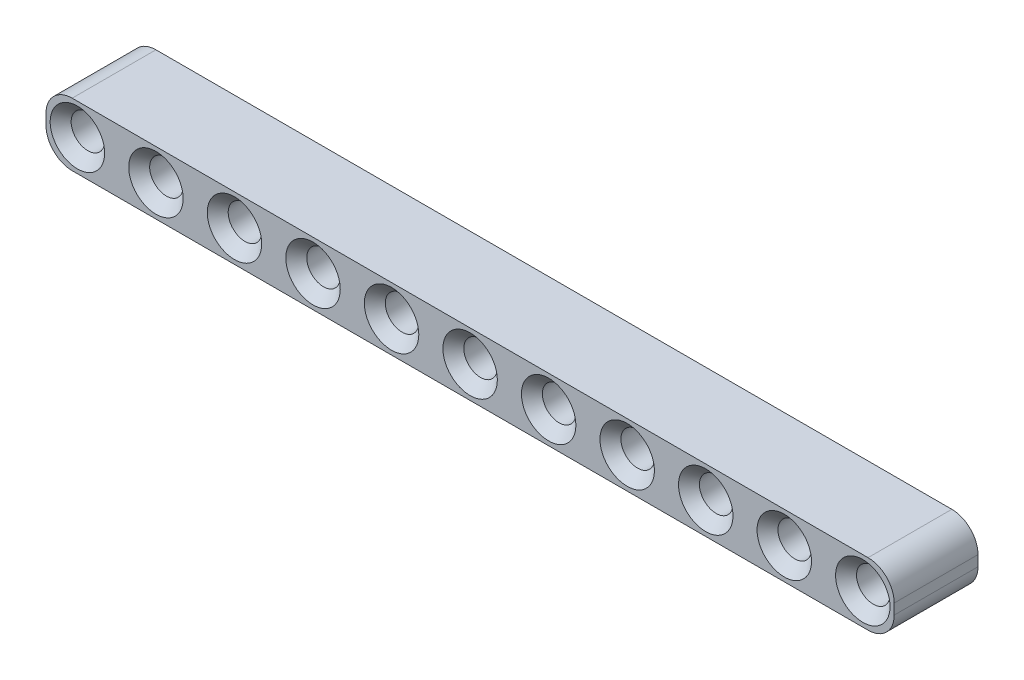
ISO-10303-21;
HEADER;
FILE_DESCRIPTION(('STEP AP214'),'2;1');
FILE_NAME('part.step','',(''),(''),'','','');
FILE_SCHEMA(('AUTOMOTIVE_DESIGN { 1 0 10303 214 1 1 1 1 }'));
ENDSEC;
DATA;
#1=APPLICATION_CONTEXT('core data for automotive mechanical design processes');
#2=APPLICATION_PROTOCOL_DEFINITION('international standard','automotive_design',2000,#1);
#3=PRODUCT_CONTEXT('',#1,'mechanical');
#4=PRODUCT('Part','Part','',(#3));
#5=PRODUCT_RELATED_PRODUCT_CATEGORY('part','',(#4));
#6=PRODUCT_DEFINITION_FORMATION('','',#4);
#7=PRODUCT_DEFINITION_CONTEXT('part definition',#1,'design');
#8=PRODUCT_DEFINITION('design','',#6,#7);
#9=PRODUCT_DEFINITION_SHAPE('','',#8);
#10=(LENGTH_UNIT() NAMED_UNIT(*) SI_UNIT(.MILLI.,.METRE.));
#11=(NAMED_UNIT(*) PLANE_ANGLE_UNIT() SI_UNIT($,.RADIAN.));
#12=(NAMED_UNIT(*) SI_UNIT($,.STERADIAN.) SOLID_ANGLE_UNIT());
#13=UNCERTAINTY_MEASURE_WITH_UNIT(LENGTH_MEASURE(1.E-05),#10,'distance_accuracy_value','');
#14=(GEOMETRIC_REPRESENTATION_CONTEXT(3) GLOBAL_UNCERTAINTY_ASSIGNED_CONTEXT((#13)) GLOBAL_UNIT_ASSIGNED_CONTEXT((#10,
#11,#12)) REPRESENTATION_CONTEXT('',''));
#15=CARTESIAN_POINT('',(0.,0.,0.));
#16=DIRECTION('',(0.,0.,1.));
#17=DIRECTION('',(1.,0.,0.));
#18=AXIS2_PLACEMENT_3D('',#15,#16,#17);
#19=CARTESIAN_POINT('',(75.5,-0.5,8.));
#20=DIRECTION('',(0.,0.,1.));
#21=DIRECTION('',(1.,0.,0.));
#22=AXIS2_PLACEMENT_3D('',#19,#20,#21);
#23=PLANE('',#22);
#24=CARTESIAN_POINT('',(75.,0.,8.));
#25=DIRECTION('',(0.,0.,1.));
#26=DIRECTION('',(1.,0.,0.));
#27=AXIS2_PLACEMENT_3D('',#24,#25,#26);
#28=CIRCLE('',#27,2.60000000000002);
#29=CARTESIAN_POINT('',(77.6,0.,8.));
#30=VERTEX_POINT('',#29);
#31=EDGE_CURVE('E228',#30,#30,#28,.F.);
#32=ORIENTED_EDGE('',*,*,#31,.T.);
#33=EDGE_LOOP('',(#32));
#34=FACE_BOUND('',#33,.T.);
#35=CARTESIAN_POINT('',(67.5,0.,8.));
#36=DIRECTION('',(0.,0.,1.));
#37=DIRECTION('',(1.,0.,0.));
#38=AXIS2_PLACEMENT_3D('',#35,#36,#37);
#39=CIRCLE('',#38,2.6);
#40=CARTESIAN_POINT('',(70.1,0.,8.));
#41=VERTEX_POINT('',#40);
#42=EDGE_CURVE('E225',#41,#41,#39,.F.);
#43=ORIENTED_EDGE('',*,*,#42,.T.);
#44=EDGE_LOOP('',(#43));
#45=FACE_BOUND('',#44,.T.);
#46=CARTESIAN_POINT('',(60.,0.,8.));
#47=DIRECTION('',(0.,0.,1.));
#48=DIRECTION('',(1.,0.,0.));
#49=AXIS2_PLACEMENT_3D('',#46,#47,#48);
#50=CIRCLE('',#49,2.6);
#51=CARTESIAN_POINT('',(62.6,0.,8.));
#52=VERTEX_POINT('',#51);
#53=EDGE_CURVE('E222',#52,#52,#50,.F.);
#54=ORIENTED_EDGE('',*,*,#53,.T.);
#55=EDGE_LOOP('',(#54));
#56=FACE_BOUND('',#55,.T.);
#57=CARTESIAN_POINT('',(52.5,0.,8.));
#58=DIRECTION('',(0.,0.,1.));
#59=DIRECTION('',(1.,0.,0.));
#60=AXIS2_PLACEMENT_3D('',#57,#58,#59);
#61=CIRCLE('',#60,2.6);
#62=CARTESIAN_POINT('',(55.1,0.,8.));
#63=VERTEX_POINT('',#62);
#64=EDGE_CURVE('E219',#63,#63,#61,.F.);
#65=ORIENTED_EDGE('',*,*,#64,.T.);
#66=EDGE_LOOP('',(#65));
#67=FACE_BOUND('',#66,.T.);
#68=CARTESIAN_POINT('',(45.,0.,8.));
#69=DIRECTION('',(0.,0.,1.));
#70=DIRECTION('',(1.,0.,0.));
#71=AXIS2_PLACEMENT_3D('',#68,#69,#70);
#72=CIRCLE('',#71,2.6);
#73=CARTESIAN_POINT('',(47.6,0.,8.));
#74=VERTEX_POINT('',#73);
#75=EDGE_CURVE('E216',#74,#74,#72,.F.);
#76=ORIENTED_EDGE('',*,*,#75,.T.);
#77=EDGE_LOOP('',(#76));
#78=FACE_BOUND('',#77,.T.);
#79=CARTESIAN_POINT('',(37.5,0.,8.));
#80=DIRECTION('',(0.,0.,1.));
#81=DIRECTION('',(1.,0.,0.));
#82=AXIS2_PLACEMENT_3D('',#79,#80,#81);
#83=CIRCLE('',#82,2.6);
#84=CARTESIAN_POINT('',(40.1,0.,8.));
#85=VERTEX_POINT('',#84);
#86=EDGE_CURVE('E213',#85,#85,#83,.F.);
#87=ORIENTED_EDGE('',*,*,#86,.T.);
#88=EDGE_LOOP('',(#87));
#89=FACE_BOUND('',#88,.T.);
#90=CARTESIAN_POINT('',(30.,0.,8.));
#91=DIRECTION('',(0.,0.,1.));
#92=DIRECTION('',(1.,0.,0.));
#93=AXIS2_PLACEMENT_3D('',#90,#91,#92);
#94=CIRCLE('',#93,2.6);
#95=CARTESIAN_POINT('',(32.6,0.,8.));
#96=VERTEX_POINT('',#95);
#97=EDGE_CURVE('E210',#96,#96,#94,.F.);
#98=ORIENTED_EDGE('',*,*,#97,.T.);
#99=EDGE_LOOP('',(#98));
#100=FACE_BOUND('',#99,.T.);
#101=CARTESIAN_POINT('',(22.5,0.,8.));
#102=DIRECTION('',(0.,0.,1.));
#103=DIRECTION('',(1.,0.,0.));
#104=AXIS2_PLACEMENT_3D('',#101,#102,#103);
#105=CIRCLE('',#104,2.6);
#106=CARTESIAN_POINT('',(25.1,0.,8.));
#107=VERTEX_POINT('',#106);
#108=EDGE_CURVE('E207',#107,#107,#105,.F.);
#109=ORIENTED_EDGE('',*,*,#108,.T.);
#110=EDGE_LOOP('',(#109));
#111=FACE_BOUND('',#110,.T.);
#112=CARTESIAN_POINT('',(15.,0.,8.));
#113=DIRECTION('',(0.,0.,1.));
#114=DIRECTION('',(1.,0.,0.));
#115=AXIS2_PLACEMENT_3D('',#112,#113,#114);
#116=CIRCLE('',#115,2.6);
#117=CARTESIAN_POINT('',(17.6,0.,8.));
#118=VERTEX_POINT('',#117);
#119=EDGE_CURVE('E204',#118,#118,#116,.F.);
#120=ORIENTED_EDGE('',*,*,#119,.T.);
#121=EDGE_LOOP('',(#120));
#122=FACE_BOUND('',#121,.T.);
#123=CARTESIAN_POINT('',(7.5,0.,8.));
#124=DIRECTION('',(0.,0.,1.));
#125=DIRECTION('',(1.,0.,0.));
#126=AXIS2_PLACEMENT_3D('',#123,#124,#125);
#127=CIRCLE('',#126,2.60000000000001);
#128=CARTESIAN_POINT('',(10.1,0.,8.));
#129=VERTEX_POINT('',#128);
#130=EDGE_CURVE('E201',#129,#129,#127,.F.);
#131=ORIENTED_EDGE('',*,*,#130,.T.);
#132=EDGE_LOOP('',(#131));
#133=FACE_BOUND('',#132,.T.);
#134=CARTESIAN_POINT('',(0.,0.,8.));
#135=DIRECTION('',(0.,0.,1.));
#136=DIRECTION('',(1.,0.,0.));
#137=AXIS2_PLACEMENT_3D('',#134,#135,#136);
#138=CIRCLE('',#137,2.6);
#139=CARTESIAN_POINT('',(2.6,0.,8.));
#140=VERTEX_POINT('',#139);
#141=EDGE_CURVE('E198',#140,#140,#138,.F.);
#142=ORIENTED_EDGE('',*,*,#141,.T.);
#143=EDGE_LOOP('',(#142));
#144=FACE_BOUND('',#143,.T.);
#145=CARTESIAN_POINT('',(75.5,-0.5,8.));
#146=DIRECTION('',(0.,0.,1.));
#147=DIRECTION('',(1.,0.,0.));
#148=AXIS2_PLACEMENT_3D('',#145,#146,#147);
#149=CIRCLE('',#148,2.49999999999999);
#150=CARTESIAN_POINT('',(75.5,-3.,8.));
#151=VERTEX_POINT('',#150);
#152=CARTESIAN_POINT('',(78.,-0.5,8.));
#153=VERTEX_POINT('',#152);
#154=EDGE_CURVE('E144',#151,#153,#149,.T.);
#155=ORIENTED_EDGE('',*,*,#154,.T.);
#156=DIRECTION('',(0.,1.,0.));
#157=VECTOR('',#156,1.);
#158=CARTESIAN_POINT('',(78.,0.5,8.));
#159=LINE('',#158,#157);
#160=CARTESIAN_POINT('',(78.,0.5,8.));
#161=VERTEX_POINT('',#160);
#162=EDGE_CURVE('E94',#153,#161,#159,.T.);
#163=ORIENTED_EDGE('',*,*,#162,.T.);
#164=CARTESIAN_POINT('',(75.5,0.5,8.));
#165=DIRECTION('',(0.,0.,1.));
#166=DIRECTION('',(-1.,0.,0.));
#167=AXIS2_PLACEMENT_3D('',#164,#165,#166);
#168=CIRCLE('',#167,2.49999999999999);
#169=CARTESIAN_POINT('',(75.5,3.,8.));
#170=VERTEX_POINT('',#169);
#171=EDGE_CURVE('E498',#161,#170,#168,.T.);
#172=ORIENTED_EDGE('',*,*,#171,.T.);
#173=DIRECTION('',(-1.,0.,0.));
#174=VECTOR('',#173,1.);
#175=CARTESIAN_POINT('',(-0.5,3.,8.));
#176=LINE('',#175,#174);
#177=CARTESIAN_POINT('',(-0.5,3.,8.));
#178=VERTEX_POINT('',#177);
#179=EDGE_CURVE('E502',#170,#178,#176,.T.);
#180=ORIENTED_EDGE('',*,*,#179,.T.);
#181=CARTESIAN_POINT('',(-0.5,0.5,8.));
#182=DIRECTION('',(0.,0.,1.));
#183=DIRECTION('',(1.,0.,0.));
#184=AXIS2_PLACEMENT_3D('',#181,#182,#183);
#185=CIRCLE('',#184,2.5);
#186=CARTESIAN_POINT('',(-3.,0.5,8.));
#187=VERTEX_POINT('',#186);
#188=EDGE_CURVE('E112',#178,#187,#185,.T.);
#189=ORIENTED_EDGE('',*,*,#188,.T.);
#190=DIRECTION('',(0.,-1.,0.));
#191=VECTOR('',#190,1.);
#192=CARTESIAN_POINT('',(-3.,0.5,8.));
#193=LINE('',#192,#191);
#194=CARTESIAN_POINT('',(-3.,-0.5,8.));
#195=VERTEX_POINT('',#194);
#196=EDGE_CURVE('E107',#187,#195,#193,.T.);
#197=ORIENTED_EDGE('',*,*,#196,.T.);
#198=CARTESIAN_POINT('',(-0.5,-0.5,8.));
#199=DIRECTION('',(0.,0.,1.));
#200=DIRECTION('',(1.,0.,0.));
#201=AXIS2_PLACEMENT_3D('',#198,#199,#200);
#202=CIRCLE('',#201,2.5);
#203=CARTESIAN_POINT('',(-0.5,-3.,8.));
#204=VERTEX_POINT('',#203);
#205=EDGE_CURVE('E110',#195,#204,#202,.T.);
#206=ORIENTED_EDGE('',*,*,#205,.T.);
#207=DIRECTION('',(1.,0.,0.));
#208=VECTOR('',#207,1.);
#209=CARTESIAN_POINT('',(-0.5,-3.,8.));
#210=LINE('',#209,#208);
#211=EDGE_CURVE('E50',#204,#151,#210,.T.);
#212=ORIENTED_EDGE('',*,*,#211,.T.);
#213=EDGE_LOOP('',(#155,#163,#172,#180,#189,#197,#206,#212));
#214=FACE_BOUND('',#213,.T.);
#215=ADVANCED_FACE('F33',(#34,#45,#56,#67,#78,#89,#100,#111,#122,#133,#144,#214),#23,.T.);
#216=CARTESIAN_POINT('',(75.5,-0.5,0.));
#217=DIRECTION('',(0.,0.,1.));
#218=DIRECTION('',(1.,0.,0.));
#219=AXIS2_PLACEMENT_3D('',#216,#217,#218);
#220=PLANE('',#219);
#221=CARTESIAN_POINT('',(75.,0.,0.));
#222=DIRECTION('',(0.,0.,1.));
#223=DIRECTION('',(1.,0.,0.));
#224=AXIS2_PLACEMENT_3D('',#221,#222,#223);
#225=CIRCLE('',#224,2.60000000000002);
#226=CARTESIAN_POINT('',(77.6,0.,0.));
#227=VERTEX_POINT('',#226);
#228=EDGE_CURVE('E189',#227,#227,#225,.T.);
#229=ORIENTED_EDGE('',*,*,#228,.T.);
#230=EDGE_LOOP('',(#229));
#231=FACE_BOUND('',#230,.T.);
#232=CARTESIAN_POINT('',(67.5,0.,0.));
#233=DIRECTION('',(0.,0.,1.));
#234=DIRECTION('',(1.,0.,0.));
#235=AXIS2_PLACEMENT_3D('',#232,#233,#234);
#236=CIRCLE('',#235,2.60000000000002);
#237=CARTESIAN_POINT('',(70.1,0.,0.));
#238=VERTEX_POINT('',#237);
#239=EDGE_CURVE('E186',#238,#238,#236,.T.);
#240=ORIENTED_EDGE('',*,*,#239,.T.);
#241=EDGE_LOOP('',(#240));
#242=FACE_BOUND('',#241,.T.);
#243=CARTESIAN_POINT('',(60.,0.,0.));
#244=DIRECTION('',(0.,0.,1.));
#245=DIRECTION('',(1.,0.,0.));
#246=AXIS2_PLACEMENT_3D('',#243,#244,#245);
#247=CIRCLE('',#246,2.6);
#248=CARTESIAN_POINT('',(62.6,0.,0.));
#249=VERTEX_POINT('',#248);
#250=EDGE_CURVE('E183',#249,#249,#247,.T.);
#251=ORIENTED_EDGE('',*,*,#250,.T.);
#252=EDGE_LOOP('',(#251));
#253=FACE_BOUND('',#252,.T.);
#254=CARTESIAN_POINT('',(52.5,0.,0.));
#255=DIRECTION('',(0.,0.,1.));
#256=DIRECTION('',(1.,0.,0.));
#257=AXIS2_PLACEMENT_3D('',#254,#255,#256);
#258=CIRCLE('',#257,2.59999999999998);
#259=CARTESIAN_POINT('',(55.1,0.,0.));
#260=VERTEX_POINT('',#259);
#261=EDGE_CURVE('E180',#260,#260,#258,.T.);
#262=ORIENTED_EDGE('',*,*,#261,.T.);
#263=EDGE_LOOP('',(#262));
#264=FACE_BOUND('',#263,.T.);
#265=CARTESIAN_POINT('',(45.,0.,0.));
#266=DIRECTION('',(0.,0.,1.));
#267=DIRECTION('',(1.,0.,0.));
#268=AXIS2_PLACEMENT_3D('',#265,#266,#267);
#269=CIRCLE('',#268,2.6);
#270=CARTESIAN_POINT('',(47.6,0.,0.));
#271=VERTEX_POINT('',#270);
#272=EDGE_CURVE('E177',#271,#271,#269,.T.);
#273=ORIENTED_EDGE('',*,*,#272,.T.);
#274=EDGE_LOOP('',(#273));
#275=FACE_BOUND('',#274,.T.);
#276=CARTESIAN_POINT('',(37.5,0.,0.));
#277=DIRECTION('',(0.,0.,1.));
#278=DIRECTION('',(1.,0.,0.));
#279=AXIS2_PLACEMENT_3D('',#276,#277,#278);
#280=CIRCLE('',#279,2.59999999999998);
#281=CARTESIAN_POINT('',(40.1,0.,0.));
#282=VERTEX_POINT('',#281);
#283=EDGE_CURVE('E174',#282,#282,#280,.T.);
#284=ORIENTED_EDGE('',*,*,#283,.T.);
#285=EDGE_LOOP('',(#284));
#286=FACE_BOUND('',#285,.T.);
#287=CARTESIAN_POINT('',(30.,0.,0.));
#288=DIRECTION('',(0.,0.,1.));
#289=DIRECTION('',(1.,0.,0.));
#290=AXIS2_PLACEMENT_3D('',#287,#288,#289);
#291=CIRCLE('',#290,2.59999999999999);
#292=CARTESIAN_POINT('',(32.6,0.,0.));
#293=VERTEX_POINT('',#292);
#294=EDGE_CURVE('E171',#293,#293,#291,.T.);
#295=ORIENTED_EDGE('',*,*,#294,.T.);
#296=EDGE_LOOP('',(#295));
#297=FACE_BOUND('',#296,.T.);
#298=CARTESIAN_POINT('',(22.5,0.,0.));
#299=DIRECTION('',(0.,0.,1.));
#300=DIRECTION('',(1.,0.,0.));
#301=AXIS2_PLACEMENT_3D('',#298,#299,#300);
#302=CIRCLE('',#301,2.59999999999999);
#303=CARTESIAN_POINT('',(25.1,0.,0.));
#304=VERTEX_POINT('',#303);
#305=EDGE_CURVE('E168',#304,#304,#302,.T.);
#306=ORIENTED_EDGE('',*,*,#305,.T.);
#307=EDGE_LOOP('',(#306));
#308=FACE_BOUND('',#307,.T.);
#309=CARTESIAN_POINT('',(15.,0.,0.));
#310=DIRECTION('',(0.,0.,1.));
#311=DIRECTION('',(1.,0.,0.));
#312=AXIS2_PLACEMENT_3D('',#309,#310,#311);
#313=CIRCLE('',#312,2.59999999999999);
#314=CARTESIAN_POINT('',(17.6,0.,0.));
#315=VERTEX_POINT('',#314);
#316=EDGE_CURVE('E165',#315,#315,#313,.T.);
#317=ORIENTED_EDGE('',*,*,#316,.T.);
#318=EDGE_LOOP('',(#317));
#319=FACE_BOUND('',#318,.T.);
#320=CARTESIAN_POINT('',(7.5,0.,0.));
#321=DIRECTION('',(0.,0.,1.));
#322=DIRECTION('',(1.,0.,0.));
#323=AXIS2_PLACEMENT_3D('',#320,#321,#322);
#324=CIRCLE('',#323,2.6);
#325=CARTESIAN_POINT('',(10.1,0.,0.));
#326=VERTEX_POINT('',#325);
#327=EDGE_CURVE('E162',#326,#326,#324,.T.);
#328=ORIENTED_EDGE('',*,*,#327,.T.);
#329=EDGE_LOOP('',(#328));
#330=FACE_BOUND('',#329,.T.);
#331=CARTESIAN_POINT('',(0.,0.,0.));
#332=DIRECTION('',(0.,0.,1.));
#333=DIRECTION('',(1.,0.,0.));
#334=AXIS2_PLACEMENT_3D('',#331,#332,#333);
#335=CIRCLE('',#334,2.6);
#336=CARTESIAN_POINT('',(2.6,0.,0.));
#337=VERTEX_POINT('',#336);
#338=EDGE_CURVE('E159',#337,#337,#335,.T.);
#339=ORIENTED_EDGE('',*,*,#338,.T.);
#340=EDGE_LOOP('',(#339));
#341=FACE_BOUND('',#340,.T.);
#342=CARTESIAN_POINT('',(75.5,-0.5,0.));
#343=DIRECTION('',(0.,0.,1.));
#344=DIRECTION('',(1.,0.,0.));
#345=AXIS2_PLACEMENT_3D('',#342,#343,#344);
#346=CIRCLE('',#345,2.49999999999999);
#347=CARTESIAN_POINT('',(75.5,-3.,0.));
#348=VERTEX_POINT('',#347);
#349=CARTESIAN_POINT('',(78.,-0.5,0.));
#350=VERTEX_POINT('',#349);
#351=EDGE_CURVE('E130',#348,#350,#346,.T.);
#352=ORIENTED_EDGE('',*,*,#351,.F.);
#353=DIRECTION('',(1.,0.,0.));
#354=VECTOR('',#353,1.);
#355=CARTESIAN_POINT('',(-0.5,-3.,0.));
#356=LINE('',#355,#354);
#357=CARTESIAN_POINT('',(-0.5,-3.,0.));
#358=VERTEX_POINT('',#357);
#359=EDGE_CURVE('E85',#358,#348,#356,.T.);
#360=ORIENTED_EDGE('',*,*,#359,.F.);
#361=CARTESIAN_POINT('',(-0.5,-0.5,0.));
#362=DIRECTION('',(0.,0.,1.));
#363=DIRECTION('',(1.,0.,0.));
#364=AXIS2_PLACEMENT_3D('',#361,#362,#363);
#365=CIRCLE('',#364,2.5);
#366=CARTESIAN_POINT('',(-3.,-0.5,0.));
#367=VERTEX_POINT('',#366);
#368=EDGE_CURVE('E79',#367,#358,#365,.T.);
#369=ORIENTED_EDGE('',*,*,#368,.F.);
#370=DIRECTION('',(0.,-1.,0.));
#371=VECTOR('',#370,1.);
#372=CARTESIAN_POINT('',(-3.,0.5,0.));
#373=LINE('',#372,#371);
#374=CARTESIAN_POINT('',(-3.,0.5,0.));
#375=VERTEX_POINT('',#374);
#376=EDGE_CURVE('E120',#375,#367,#373,.T.);
#377=ORIENTED_EDGE('',*,*,#376,.F.);
#378=CARTESIAN_POINT('',(-0.5,0.5,0.));
#379=DIRECTION('',(0.,0.,1.));
#380=DIRECTION('',(1.,0.,0.));
#381=AXIS2_PLACEMENT_3D('',#378,#379,#380);
#382=CIRCLE('',#381,2.5);
#383=CARTESIAN_POINT('',(-0.5,3.,0.));
#384=VERTEX_POINT('',#383);
#385=EDGE_CURVE('E139',#384,#375,#382,.T.);
#386=ORIENTED_EDGE('',*,*,#385,.F.);
#387=DIRECTION('',(-1.,0.,0.));
#388=VECTOR('',#387,1.);
#389=CARTESIAN_POINT('',(-0.5,3.,0.));
#390=LINE('',#389,#388);
#391=CARTESIAN_POINT('',(75.5,3.,0.));
#392=VERTEX_POINT('',#391);
#393=EDGE_CURVE('E137',#392,#384,#390,.T.);
#394=ORIENTED_EDGE('',*,*,#393,.F.);
#395=CARTESIAN_POINT('',(75.5,0.5,0.));
#396=DIRECTION('',(0.,0.,1.));
#397=DIRECTION('',(-1.,0.,0.));
#398=AXIS2_PLACEMENT_3D('',#395,#396,#397);
#399=CIRCLE('',#398,2.49999999999999);
#400=CARTESIAN_POINT('',(78.,0.5,0.));
#401=VERTEX_POINT('',#400);
#402=EDGE_CURVE('E135',#401,#392,#399,.T.);
#403=ORIENTED_EDGE('',*,*,#402,.F.);
#404=DIRECTION('',(0.,1.,0.));
#405=VECTOR('',#404,1.);
#406=CARTESIAN_POINT('',(78.,0.5,0.));
#407=LINE('',#406,#405);
#408=EDGE_CURVE('E133',#350,#401,#407,.T.);
#409=ORIENTED_EDGE('',*,*,#408,.F.);
#410=EDGE_LOOP('',(#352,#360,#369,#377,#386,#394,#403,#409));
#411=FACE_BOUND('',#410,.T.);
#412=ADVANCED_FACE('F299',(#231,#242,#253,#264,#275,#286,#297,#308,#319,#330,#341,#411),#220,.F.);
#413=CARTESIAN_POINT('',(75.5,-0.5,8.));
#414=DIRECTION('',(0.,0.,-1.));
#415=DIRECTION('',(-1.,0.,0.));
#416=AXIS2_PLACEMENT_3D('',#413,#414,#415);
#417=CYLINDRICAL_SURFACE('',#416,2.49999999999999);
#418=ORIENTED_EDGE('',*,*,#351,.T.);
#419=DIRECTION('',(0.,0.,-1.));
#420=VECTOR('',#419,1.);
#421=CARTESIAN_POINT('',(78.,-0.5,8.));
#422=LINE('',#421,#420);
#423=EDGE_CURVE('E157',#153,#350,#422,.T.);
#424=ORIENTED_EDGE('',*,*,#423,.F.);
#425=ORIENTED_EDGE('',*,*,#154,.F.);
#426=DIRECTION('',(0.,0.,-1.));
#427=VECTOR('',#426,1.);
#428=CARTESIAN_POINT('',(75.5,-3.,8.));
#429=LINE('',#428,#427);
#430=EDGE_CURVE('E126',#151,#348,#429,.T.);
#431=ORIENTED_EDGE('',*,*,#430,.T.);
#432=EDGE_LOOP('',(#418,#424,#425,#431));
#433=FACE_BOUND('',#432,.T.);
#434=ADVANCED_FACE('F305',(#433),#417,.T.);
#435=CARTESIAN_POINT('',(78.,0.5,8.));
#436=DIRECTION('',(-1.,0.,0.));
#437=DIRECTION('',(0.,0.,1.));
#438=AXIS2_PLACEMENT_3D('',#435,#436,#437);
#439=PLANE('',#438);
#440=ORIENTED_EDGE('',*,*,#408,.T.);
#441=DIRECTION('',(0.,0.,-1.));
#442=VECTOR('',#441,1.);
#443=CARTESIAN_POINT('',(78.,0.5,8.));
#444=LINE('',#443,#442);
#445=EDGE_CURVE('E154',#161,#401,#444,.T.);
#446=ORIENTED_EDGE('',*,*,#445,.F.);
#447=ORIENTED_EDGE('',*,*,#162,.F.);
#448=ORIENTED_EDGE('',*,*,#423,.T.);
#449=EDGE_LOOP('',(#440,#446,#447,#448));
#450=FACE_BOUND('',#449,.T.);
#451=ADVANCED_FACE('F330',(#450),#439,.F.);
#452=CARTESIAN_POINT('',(75.5,0.5,8.));
#453=DIRECTION('',(0.,0.,-1.));
#454=DIRECTION('',(-1.,0.,0.));
#455=AXIS2_PLACEMENT_3D('',#452,#453,#454);
#456=CYLINDRICAL_SURFACE('',#455,2.49999999999999);
#457=ORIENTED_EDGE('',*,*,#402,.T.);
#458=DIRECTION('',(0.,0.,-1.));
#459=VECTOR('',#458,1.);
#460=CARTESIAN_POINT('',(75.5,3.,8.));
#461=LINE('',#460,#459);
#462=EDGE_CURVE('E151',#170,#392,#461,.T.);
#463=ORIENTED_EDGE('',*,*,#462,.F.);
#464=ORIENTED_EDGE('',*,*,#171,.F.);
#465=ORIENTED_EDGE('',*,*,#445,.T.);
#466=EDGE_LOOP('',(#457,#463,#464,#465));
#467=FACE_BOUND('',#466,.T.);
#468=ADVANCED_FACE('F326',(#467),#456,.T.);
#469=CARTESIAN_POINT('',(-0.5,3.,8.));
#470=DIRECTION('',(0.,-1.,0.));
#471=DIRECTION('',(1.,0.,0.));
#472=AXIS2_PLACEMENT_3D('',#469,#470,#471);
#473=PLANE('',#472);
#474=ORIENTED_EDGE('',*,*,#393,.T.);
#475=DIRECTION('',(0.,0.,-1.));
#476=VECTOR('',#475,1.);
#477=CARTESIAN_POINT('',(-0.5,3.,8.));
#478=LINE('',#477,#476);
#479=EDGE_CURVE('E148',#178,#384,#478,.T.);
#480=ORIENTED_EDGE('',*,*,#479,.F.);
#481=ORIENTED_EDGE('',*,*,#179,.F.);
#482=ORIENTED_EDGE('',*,*,#462,.T.);
#483=EDGE_LOOP('',(#474,#480,#481,#482));
#484=FACE_BOUND('',#483,.T.);
#485=ADVANCED_FACE('F322',(#484),#473,.F.);
#486=CARTESIAN_POINT('',(-0.5,0.5,8.));
#487=DIRECTION('',(0.,0.,-1.));
#488=DIRECTION('',(-1.,0.,0.));
#489=AXIS2_PLACEMENT_3D('',#486,#487,#488);
#490=CYLINDRICAL_SURFACE('',#489,2.5);
#491=ORIENTED_EDGE('',*,*,#385,.T.);
#492=DIRECTION('',(0.,0.,-1.));
#493=VECTOR('',#492,1.);
#494=CARTESIAN_POINT('',(-3.,0.5,8.));
#495=LINE('',#494,#493);
#496=EDGE_CURVE('E121',#187,#375,#495,.T.);
#497=ORIENTED_EDGE('',*,*,#496,.F.);
#498=ORIENTED_EDGE('',*,*,#188,.F.);
#499=ORIENTED_EDGE('',*,*,#479,.T.);
#500=EDGE_LOOP('',(#491,#497,#498,#499));
#501=FACE_BOUND('',#500,.T.);
#502=ADVANCED_FACE('F319',(#501),#490,.T.);
#503=CARTESIAN_POINT('',(-3.,0.5,8.));
#504=DIRECTION('',(1.,0.,0.));
#505=DIRECTION('',(0.,0.,-1.));
#506=AXIS2_PLACEMENT_3D('',#503,#504,#505);
#507=PLANE('',#506);
#508=ORIENTED_EDGE('',*,*,#376,.T.);
#509=DIRECTION('',(0.,0.,-1.));
#510=VECTOR('',#509,1.);
#511=CARTESIAN_POINT('',(-3.,-0.5,8.));
#512=LINE('',#511,#510);
#513=EDGE_CURVE('E117',#195,#367,#512,.T.);
#514=ORIENTED_EDGE('',*,*,#513,.F.);
#515=ORIENTED_EDGE('',*,*,#196,.F.);
#516=ORIENTED_EDGE('',*,*,#496,.T.);
#517=EDGE_LOOP('',(#508,#514,#515,#516));
#518=FACE_BOUND('',#517,.T.);
#519=ADVANCED_FACE('F118',(#518),#507,.F.);
#520=CARTESIAN_POINT('',(-0.5,-0.5,8.));
#521=DIRECTION('',(0.,0.,-1.));
#522=DIRECTION('',(-1.,0.,0.));
#523=AXIS2_PLACEMENT_3D('',#520,#521,#522);
#524=CYLINDRICAL_SURFACE('',#523,2.5);
#525=ORIENTED_EDGE('',*,*,#368,.T.);
#526=DIRECTION('',(0.,0.,-1.));
#527=VECTOR('',#526,1.);
#528=CARTESIAN_POINT('',(-0.5,-3.,8.));
#529=LINE('',#528,#527);
#530=EDGE_CURVE('E122',#204,#358,#529,.T.);
#531=ORIENTED_EDGE('',*,*,#530,.F.);
#532=ORIENTED_EDGE('',*,*,#205,.F.);
#533=ORIENTED_EDGE('',*,*,#513,.T.);
#534=EDGE_LOOP('',(#525,#531,#532,#533));
#535=FACE_BOUND('',#534,.T.);
#536=ADVANCED_FACE('F124',(#535),#524,.T.);
#537=CARTESIAN_POINT('',(-0.5,-3.,8.));
#538=DIRECTION('',(0.,1.,0.));
#539=DIRECTION('',(-1.,0.,0.));
#540=AXIS2_PLACEMENT_3D('',#537,#538,#539);
#541=PLANE('',#540);
#542=ORIENTED_EDGE('',*,*,#359,.T.);
#543=ORIENTED_EDGE('',*,*,#430,.F.);
#544=ORIENTED_EDGE('',*,*,#211,.F.);
#545=ORIENTED_EDGE('',*,*,#530,.T.);
#546=EDGE_LOOP('',(#542,#543,#544,#545));
#547=FACE_BOUND('',#546,.T.);
#548=ADVANCED_FACE('F312',(#547),#541,.F.);
#549=CARTESIAN_POINT('',(0.,0.,8.));
#550=DIRECTION('',(0.,0.,-1.));
#551=DIRECTION('',(-1.,0.,0.));
#552=AXIS2_PLACEMENT_3D('',#549,#550,#551);
#553=CYLINDRICAL_SURFACE('',#552,1.6);
#554=CARTESIAN_POINT('',(0.,0.,0.999999999999999));
#555=DIRECTION('',(0.,0.,1.));
#556=DIRECTION('',(1.,0.,0.));
#557=AXIS2_PLACEMENT_3D('',#554,#555,#556);
#558=CIRCLE('',#557,1.6);
#559=CARTESIAN_POINT('',(1.6,0.,0.999999999999999));
#560=VERTEX_POINT('',#559);
#561=EDGE_CURVE('E11',#560,#560,#558,.F.);
#562=ORIENTED_EDGE('',*,*,#561,.T.);
#563=EDGE_LOOP('',(#562));
#564=FACE_BOUND('',#563,.T.);
#565=CARTESIAN_POINT('',(0.,0.,7.00000000000001));
#566=DIRECTION('',(0.,0.,1.));
#567=DIRECTION('',(1.,0.,0.));
#568=AXIS2_PLACEMENT_3D('',#565,#566,#567);
#569=CIRCLE('',#568,1.6);
#570=CARTESIAN_POINT('',(1.6,0.,7.00000000000001));
#571=VERTEX_POINT('',#570);
#572=EDGE_CURVE('E42',#571,#571,#569,.T.);
#573=ORIENTED_EDGE('',*,*,#572,.T.);
#574=EDGE_LOOP('',(#573));
#575=FACE_BOUND('',#574,.T.);
#576=ADVANCED_FACE('F287',(#564,#575),#553,.F.);
#577=CARTESIAN_POINT('',(7.5,0.,8.));
#578=DIRECTION('',(0.,0.,-1.));
#579=DIRECTION('',(-1.,0.,0.));
#580=AXIS2_PLACEMENT_3D('',#577,#578,#579);
#581=CYLINDRICAL_SURFACE('',#580,1.6);
#582=CARTESIAN_POINT('',(7.5,0.,0.999999999999997));
#583=DIRECTION('',(0.,0.,1.));
#584=DIRECTION('',(1.,0.,0.));
#585=AXIS2_PLACEMENT_3D('',#582,#583,#584);
#586=CIRCLE('',#585,1.6);
#587=CARTESIAN_POINT('',(9.1,0.,0.999999999999997));
#588=VERTEX_POINT('',#587);
#589=EDGE_CURVE('E282',#588,#588,#586,.F.);
#590=ORIENTED_EDGE('',*,*,#589,.T.);
#591=EDGE_LOOP('',(#590));
#592=FACE_BOUND('',#591,.T.);
#593=CARTESIAN_POINT('',(7.5,0.,7.));
#594=DIRECTION('',(0.,0.,1.));
#595=DIRECTION('',(1.,0.,0.));
#596=AXIS2_PLACEMENT_3D('',#593,#594,#595);
#597=CIRCLE('',#596,1.6);
#598=CARTESIAN_POINT('',(9.1,0.,7.));
#599=VERTEX_POINT('',#598);
#600=EDGE_CURVE('E279',#599,#599,#597,.T.);
#601=ORIENTED_EDGE('',*,*,#600,.T.);
#602=EDGE_LOOP('',(#601));
#603=FACE_BOUND('',#602,.T.);
#604=ADVANCED_FACE('F422',(#592,#603),#581,.F.);
#605=CARTESIAN_POINT('',(15.,0.,8.));
#606=DIRECTION('',(0.,0.,-1.));
#607=DIRECTION('',(-1.,0.,0.));
#608=AXIS2_PLACEMENT_3D('',#605,#606,#607);
#609=CYLINDRICAL_SURFACE('',#608,1.6);
#610=CARTESIAN_POINT('',(15.,0.,1.));
#611=DIRECTION('',(0.,0.,1.));
#612=DIRECTION('',(1.,0.,0.));
#613=AXIS2_PLACEMENT_3D('',#610,#611,#612);
#614=CIRCLE('',#613,1.6);
#615=CARTESIAN_POINT('',(16.6,0.,1.));
#616=VERTEX_POINT('',#615);
#617=EDGE_CURVE('E276',#616,#616,#614,.F.);
#618=ORIENTED_EDGE('',*,*,#617,.T.);
#619=EDGE_LOOP('',(#618));
#620=FACE_BOUND('',#619,.T.);
#621=CARTESIAN_POINT('',(15.,0.,6.99999999999999));
#622=DIRECTION('',(0.,0.,1.));
#623=DIRECTION('',(1.,0.,0.));
#624=AXIS2_PLACEMENT_3D('',#621,#622,#623);
#625=CIRCLE('',#624,1.6);
#626=CARTESIAN_POINT('',(16.6,0.,6.99999999999999));
#627=VERTEX_POINT('',#626);
#628=EDGE_CURVE('E273',#627,#627,#625,.T.);
#629=ORIENTED_EDGE('',*,*,#628,.T.);
#630=EDGE_LOOP('',(#629));
#631=FACE_BOUND('',#630,.T.);
#632=ADVANCED_FACE('F424',(#620,#631),#609,.F.);
#633=CARTESIAN_POINT('',(22.5,0.,8.));
#634=DIRECTION('',(0.,0.,-1.));
#635=DIRECTION('',(-1.,0.,0.));
#636=AXIS2_PLACEMENT_3D('',#633,#634,#635);
#637=CYLINDRICAL_SURFACE('',#636,1.6);
#638=CARTESIAN_POINT('',(22.5,0.,1.));
#639=DIRECTION('',(0.,0.,1.));
#640=DIRECTION('',(1.,0.,0.));
#641=AXIS2_PLACEMENT_3D('',#638,#639,#640);
#642=CIRCLE('',#641,1.6);
#643=CARTESIAN_POINT('',(24.1,0.,1.));
#644=VERTEX_POINT('',#643);
#645=EDGE_CURVE('E270',#644,#644,#642,.F.);
#646=ORIENTED_EDGE('',*,*,#645,.T.);
#647=EDGE_LOOP('',(#646));
#648=FACE_BOUND('',#647,.T.);
#649=CARTESIAN_POINT('',(22.5,0.,6.99999999999999));
#650=DIRECTION('',(0.,0.,1.));
#651=DIRECTION('',(1.,0.,0.));
#652=AXIS2_PLACEMENT_3D('',#649,#650,#651);
#653=CIRCLE('',#652,1.6);
#654=CARTESIAN_POINT('',(24.1,0.,6.99999999999999));
#655=VERTEX_POINT('',#654);
#656=EDGE_CURVE('E267',#655,#655,#653,.T.);
#657=ORIENTED_EDGE('',*,*,#656,.T.);
#658=EDGE_LOOP('',(#657));
#659=FACE_BOUND('',#658,.T.);
#660=ADVANCED_FACE('F430',(#648,#659),#637,.F.);
#661=CARTESIAN_POINT('',(30.,0.,8.));
#662=DIRECTION('',(0.,0.,-1.));
#663=DIRECTION('',(-1.,0.,0.));
#664=AXIS2_PLACEMENT_3D('',#661,#662,#663);
#665=CYLINDRICAL_SURFACE('',#664,1.6);
#666=CARTESIAN_POINT('',(30.,0.,1.));
#667=DIRECTION('',(0.,0.,1.));
#668=DIRECTION('',(1.,0.,0.));
#669=AXIS2_PLACEMENT_3D('',#666,#667,#668);
#670=CIRCLE('',#669,1.6);
#671=CARTESIAN_POINT('',(31.6,0.,1.));
#672=VERTEX_POINT('',#671);
#673=EDGE_CURVE('E264',#672,#672,#670,.F.);
#674=ORIENTED_EDGE('',*,*,#673,.T.);
#675=EDGE_LOOP('',(#674));
#676=FACE_BOUND('',#675,.T.);
#677=CARTESIAN_POINT('',(30.,0.,6.99999999999999));
#678=DIRECTION('',(0.,0.,1.));
#679=DIRECTION('',(1.,0.,0.));
#680=AXIS2_PLACEMENT_3D('',#677,#678,#679);
#681=CIRCLE('',#680,1.6);
#682=CARTESIAN_POINT('',(31.6,0.,6.99999999999999));
#683=VERTEX_POINT('',#682);
#684=EDGE_CURVE('E261',#683,#683,#681,.T.);
#685=ORIENTED_EDGE('',*,*,#684,.T.);
#686=EDGE_LOOP('',(#685));
#687=FACE_BOUND('',#686,.T.);
#688=ADVANCED_FACE('F437',(#676,#687),#665,.F.);
#689=CARTESIAN_POINT('',(37.5,0.,8.));
#690=DIRECTION('',(0.,0.,-1.));
#691=DIRECTION('',(-1.,0.,0.));
#692=AXIS2_PLACEMENT_3D('',#689,#690,#691);
#693=CYLINDRICAL_SURFACE('',#692,1.6);
#694=CARTESIAN_POINT('',(37.5,0.,0.999999999999997));
#695=DIRECTION('',(0.,0.,1.));
#696=DIRECTION('',(1.,0.,0.));
#697=AXIS2_PLACEMENT_3D('',#694,#695,#696);
#698=CIRCLE('',#697,1.6);
#699=CARTESIAN_POINT('',(39.1,0.,0.999999999999997));
#700=VERTEX_POINT('',#699);
#701=EDGE_CURVE('E258',#700,#700,#698,.F.);
#702=ORIENTED_EDGE('',*,*,#701,.T.);
#703=EDGE_LOOP('',(#702));
#704=FACE_BOUND('',#703,.T.);
#705=CARTESIAN_POINT('',(37.5,0.,6.99999999999999));
#706=DIRECTION('',(0.,0.,1.));
#707=DIRECTION('',(1.,0.,0.));
#708=AXIS2_PLACEMENT_3D('',#705,#706,#707);
#709=CIRCLE('',#708,1.6);
#710=CARTESIAN_POINT('',(39.1,0.,6.99999999999999));
#711=VERTEX_POINT('',#710);
#712=EDGE_CURVE('E255',#711,#711,#709,.T.);
#713=ORIENTED_EDGE('',*,*,#712,.T.);
#714=EDGE_LOOP('',(#713));
#715=FACE_BOUND('',#714,.T.);
#716=ADVANCED_FACE('F441',(#704,#715),#693,.F.);
#717=CARTESIAN_POINT('',(45.,0.,8.));
#718=DIRECTION('',(0.,0.,-1.));
#719=DIRECTION('',(-1.,0.,0.));
#720=AXIS2_PLACEMENT_3D('',#717,#718,#719);
#721=CYLINDRICAL_SURFACE('',#720,1.6);
#722=CARTESIAN_POINT('',(45.,0.,1.00000000000002));
#723=DIRECTION('',(0.,0.,1.));
#724=DIRECTION('',(1.,0.,0.));
#725=AXIS2_PLACEMENT_3D('',#722,#723,#724);
#726=CIRCLE('',#725,1.6);
#727=CARTESIAN_POINT('',(46.6,0.,1.00000000000002));
#728=VERTEX_POINT('',#727);
#729=EDGE_CURVE('E252',#728,#728,#726,.F.);
#730=ORIENTED_EDGE('',*,*,#729,.T.);
#731=EDGE_LOOP('',(#730));
#732=FACE_BOUND('',#731,.T.);
#733=CARTESIAN_POINT('',(45.,0.,6.99999999999999));
#734=DIRECTION('',(0.,0.,1.));
#735=DIRECTION('',(1.,0.,0.));
#736=AXIS2_PLACEMENT_3D('',#733,#734,#735);
#737=CIRCLE('',#736,1.6);
#738=CARTESIAN_POINT('',(46.6,0.,6.99999999999999));
#739=VERTEX_POINT('',#738);
#740=EDGE_CURVE('E249',#739,#739,#737,.T.);
#741=ORIENTED_EDGE('',*,*,#740,.T.);
#742=EDGE_LOOP('',(#741));
#743=FACE_BOUND('',#742,.T.);
#744=ADVANCED_FACE('F445',(#732,#743),#721,.F.);
#745=CARTESIAN_POINT('',(52.5,0.,8.));
#746=DIRECTION('',(0.,0.,-1.));
#747=DIRECTION('',(-1.,0.,0.));
#748=AXIS2_PLACEMENT_3D('',#745,#746,#747);
#749=CYLINDRICAL_SURFACE('',#748,1.6);
#750=CARTESIAN_POINT('',(52.5,0.,0.999999999999997));
#751=DIRECTION('',(0.,0.,1.));
#752=DIRECTION('',(1.,0.,0.));
#753=AXIS2_PLACEMENT_3D('',#750,#751,#752);
#754=CIRCLE('',#753,1.6);
#755=CARTESIAN_POINT('',(54.1,0.,0.999999999999997));
#756=VERTEX_POINT('',#755);
#757=EDGE_CURVE('E246',#756,#756,#754,.F.);
#758=ORIENTED_EDGE('',*,*,#757,.T.);
#759=EDGE_LOOP('',(#758));
#760=FACE_BOUND('',#759,.T.);
#761=CARTESIAN_POINT('',(52.5,0.,6.99999999999999));
#762=DIRECTION('',(0.,0.,1.));
#763=DIRECTION('',(1.,0.,0.));
#764=AXIS2_PLACEMENT_3D('',#761,#762,#763);
#765=CIRCLE('',#764,1.6);
#766=CARTESIAN_POINT('',(54.1,0.,6.99999999999999));
#767=VERTEX_POINT('',#766);
#768=EDGE_CURVE('E243',#767,#767,#765,.T.);
#769=ORIENTED_EDGE('',*,*,#768,.T.);
#770=EDGE_LOOP('',(#769));
#771=FACE_BOUND('',#770,.T.);
#772=ADVANCED_FACE('F449',(#760,#771),#749,.F.);
#773=CARTESIAN_POINT('',(60.,0.,8.));
#774=DIRECTION('',(0.,0.,-1.));
#775=DIRECTION('',(-1.,0.,0.));
#776=AXIS2_PLACEMENT_3D('',#773,#774,#775);
#777=CYLINDRICAL_SURFACE('',#776,1.60000000000001);
#778=CARTESIAN_POINT('',(60.,0.,1.00000000000001));
#779=DIRECTION('',(0.,0.,1.));
#780=DIRECTION('',(1.,0.,0.));
#781=AXIS2_PLACEMENT_3D('',#778,#779,#780);
#782=CIRCLE('',#781,1.60000000000001);
#783=CARTESIAN_POINT('',(61.6,0.,1.00000000000001));
#784=VERTEX_POINT('',#783);
#785=EDGE_CURVE('E240',#784,#784,#782,.F.);
#786=ORIENTED_EDGE('',*,*,#785,.T.);
#787=EDGE_LOOP('',(#786));
#788=FACE_BOUND('',#787,.T.);
#789=CARTESIAN_POINT('',(60.,0.,7.));
#790=DIRECTION('',(0.,0.,1.));
#791=DIRECTION('',(1.,0.,0.));
#792=AXIS2_PLACEMENT_3D('',#789,#790,#791);
#793=CIRCLE('',#792,1.60000000000001);
#794=CARTESIAN_POINT('',(61.6,0.,7.));
#795=VERTEX_POINT('',#794);
#796=EDGE_CURVE('E237',#795,#795,#793,.T.);
#797=ORIENTED_EDGE('',*,*,#796,.T.);
#798=EDGE_LOOP('',(#797));
#799=FACE_BOUND('',#798,.T.);
#800=ADVANCED_FACE('F453',(#788,#799),#777,.F.);
#801=CARTESIAN_POINT('',(67.5,0.,8.));
#802=DIRECTION('',(0.,0.,-1.));
#803=DIRECTION('',(-1.,0.,0.));
#804=AXIS2_PLACEMENT_3D('',#801,#802,#803);
#805=CYLINDRICAL_SURFACE('',#804,1.60000000000001);
#806=CARTESIAN_POINT('',(67.5,0.,1.00000000000001));
#807=DIRECTION('',(0.,0.,1.));
#808=DIRECTION('',(1.,0.,0.));
#809=AXIS2_PLACEMENT_3D('',#806,#807,#808);
#810=CIRCLE('',#809,1.60000000000001);
#811=CARTESIAN_POINT('',(69.1,0.,1.00000000000001));
#812=VERTEX_POINT('',#811);
#813=EDGE_CURVE('E234',#812,#812,#810,.F.);
#814=ORIENTED_EDGE('',*,*,#813,.T.);
#815=EDGE_LOOP('',(#814));
#816=FACE_BOUND('',#815,.T.);
#817=CARTESIAN_POINT('',(67.5,0.,7.));
#818=DIRECTION('',(0.,0.,1.));
#819=DIRECTION('',(1.,0.,0.));
#820=AXIS2_PLACEMENT_3D('',#817,#818,#819);
#821=CIRCLE('',#820,1.60000000000001);
#822=CARTESIAN_POINT('',(69.1,0.,7.));
#823=VERTEX_POINT('',#822);
#824=EDGE_CURVE('E231',#823,#823,#821,.T.);
#825=ORIENTED_EDGE('',*,*,#824,.T.);
#826=EDGE_LOOP('',(#825));
#827=FACE_BOUND('',#826,.T.);
#828=ADVANCED_FACE('F457',(#816,#827),#805,.F.);
#829=CARTESIAN_POINT('',(75.,0.,8.));
#830=DIRECTION('',(0.,0.,-1.));
#831=DIRECTION('',(-1.,0.,0.));
#832=AXIS2_PLACEMENT_3D('',#829,#830,#831);
#833=CYLINDRICAL_SURFACE('',#832,1.60000000000001);
#834=CARTESIAN_POINT('',(75.,0.,1.00000000000001));
#835=DIRECTION('',(0.,0.,1.));
#836=DIRECTION('',(1.,0.,0.));
#837=AXIS2_PLACEMENT_3D('',#834,#835,#836);
#838=CIRCLE('',#837,1.60000000000001);
#839=CARTESIAN_POINT('',(76.6,0.,1.00000000000001));
#840=VERTEX_POINT('',#839);
#841=EDGE_CURVE('E195',#840,#840,#838,.F.);
#842=ORIENTED_EDGE('',*,*,#841,.T.);
#843=EDGE_LOOP('',(#842));
#844=FACE_BOUND('',#843,.T.);
#845=CARTESIAN_POINT('',(75.,0.,7.));
#846=DIRECTION('',(0.,0.,1.));
#847=DIRECTION('',(1.,0.,0.));
#848=AXIS2_PLACEMENT_3D('',#845,#846,#847);
#849=CIRCLE('',#848,1.60000000000001);
#850=CARTESIAN_POINT('',(76.6,0.,7.));
#851=VERTEX_POINT('',#850);
#852=EDGE_CURVE('E192',#851,#851,#849,.T.);
#853=ORIENTED_EDGE('',*,*,#852,.T.);
#854=EDGE_LOOP('',(#853));
#855=FACE_BOUND('',#854,.T.);
#856=ADVANCED_FACE('F341',(#844,#855),#833,.F.);
#857=CARTESIAN_POINT('',(75.,0.,0.));
#858=DIRECTION('',(0.,0.,-1.));
#859=DIRECTION('',(-1.,0.,0.));
#860=AXIS2_PLACEMENT_3D('',#857,#858,#859);
#861=CONICAL_SURFACE('',#860,2.60000000000002,0.785398163397452);
#862=ORIENTED_EDGE('',*,*,#841,.F.);
#863=EDGE_LOOP('',(#862));
#864=FACE_BOUND('',#863,.T.);
#865=ORIENTED_EDGE('',*,*,#228,.F.);
#866=EDGE_LOOP('',(#865));
#867=FACE_BOUND('',#866,.T.);
#868=ADVANCED_FACE('F337',(#864,#867),#861,.F.);
#869=CARTESIAN_POINT('',(75.,0.,7.));
#870=DIRECTION('',(0.,0.,1.));
#871=DIRECTION('',(1.,0.,0.));
#872=AXIS2_PLACEMENT_3D('',#869,#870,#871);
#873=CONICAL_SURFACE('',#872,1.60000000000001,0.785398163397456);
#874=ORIENTED_EDGE('',*,*,#31,.F.);
#875=EDGE_LOOP('',(#874));
#876=FACE_BOUND('',#875,.T.);
#877=ORIENTED_EDGE('',*,*,#852,.F.);
#878=EDGE_LOOP('',(#877));
#879=FACE_BOUND('',#878,.T.);
#880=ADVANCED_FACE('F340',(#876,#879),#873,.F.);
#881=CARTESIAN_POINT('',(67.5,0.,0.));
#882=DIRECTION('',(0.,0.,-1.));
#883=DIRECTION('',(-1.,0.,0.));
#884=AXIS2_PLACEMENT_3D('',#881,#882,#883);
#885=CONICAL_SURFACE('',#884,2.60000000000002,0.785398163397452);
#886=ORIENTED_EDGE('',*,*,#813,.F.);
#887=EDGE_LOOP('',(#886));
#888=FACE_BOUND('',#887,.T.);
#889=ORIENTED_EDGE('',*,*,#239,.F.);
#890=EDGE_LOOP('',(#889));
#891=FACE_BOUND('',#890,.T.);
#892=ADVANCED_FACE('F345',(#888,#891),#885,.F.);
#893=CARTESIAN_POINT('',(67.5,0.,7.));
#894=DIRECTION('',(0.,0.,1.));
#895=DIRECTION('',(1.,0.,0.));
#896=AXIS2_PLACEMENT_3D('',#893,#894,#895);
#897=CONICAL_SURFACE('',#896,1.60000000000001,0.785398163397449);
#898=ORIENTED_EDGE('',*,*,#42,.F.);
#899=EDGE_LOOP('',(#898));
#900=FACE_BOUND('',#899,.T.);
#901=ORIENTED_EDGE('',*,*,#824,.F.);
#902=EDGE_LOOP('',(#901));
#903=FACE_BOUND('',#902,.T.);
#904=ADVANCED_FACE('F349',(#900,#903),#897,.F.);
#905=CARTESIAN_POINT('',(60.,0.,0.));
#906=DIRECTION('',(0.,0.,-1.));
#907=DIRECTION('',(-1.,0.,0.));
#908=AXIS2_PLACEMENT_3D('',#905,#906,#907);
#909=CONICAL_SURFACE('',#908,2.6,0.785398163397439);
#910=ORIENTED_EDGE('',*,*,#785,.F.);
#911=EDGE_LOOP('',(#910));
#912=FACE_BOUND('',#911,.T.);
#913=ORIENTED_EDGE('',*,*,#250,.F.);
#914=EDGE_LOOP('',(#913));
#915=FACE_BOUND('',#914,.T.);
#916=ADVANCED_FACE('F353',(#912,#915),#909,.F.);
#917=CARTESIAN_POINT('',(60.,0.,7.));
#918=DIRECTION('',(0.,0.,1.));
#919=DIRECTION('',(1.,0.,0.));
#920=AXIS2_PLACEMENT_3D('',#917,#918,#919);
#921=CONICAL_SURFACE('',#920,1.60000000000001,0.785398163397452);
#922=ORIENTED_EDGE('',*,*,#53,.F.);
#923=EDGE_LOOP('',(#922));
#924=FACE_BOUND('',#923,.T.);
#925=ORIENTED_EDGE('',*,*,#796,.F.);
#926=EDGE_LOOP('',(#925));
#927=FACE_BOUND('',#926,.T.);
#928=ADVANCED_FACE('F357',(#924,#927),#921,.F.);
#929=CARTESIAN_POINT('',(52.5,0.,0.));
#930=DIRECTION('',(0.,0.,-1.));
#931=DIRECTION('',(-1.,0.,0.));
#932=AXIS2_PLACEMENT_3D('',#929,#930,#931);
#933=CONICAL_SURFACE('',#932,2.59999999999998,0.785398163397443);
#934=ORIENTED_EDGE('',*,*,#757,.F.);
#935=EDGE_LOOP('',(#934));
#936=FACE_BOUND('',#935,.T.);
#937=ORIENTED_EDGE('',*,*,#261,.F.);
#938=EDGE_LOOP('',(#937));
#939=FACE_BOUND('',#938,.T.);
#940=ADVANCED_FACE('F361',(#936,#939),#933,.F.);
#941=CARTESIAN_POINT('',(52.5,0.,6.99999999999999));
#942=DIRECTION('',(0.,0.,1.));
#943=DIRECTION('',(1.,0.,0.));
#944=AXIS2_PLACEMENT_3D('',#941,#942,#943);
#945=CONICAL_SURFACE('',#944,1.6,0.785398163397449);
#946=ORIENTED_EDGE('',*,*,#64,.F.);
#947=EDGE_LOOP('',(#946));
#948=FACE_BOUND('',#947,.T.);
#949=ORIENTED_EDGE('',*,*,#768,.F.);
#950=EDGE_LOOP('',(#949));
#951=FACE_BOUND('',#950,.T.);
#952=ADVANCED_FACE('F365',(#948,#951),#945,.F.);
#953=CARTESIAN_POINT('',(45.,0.,0.));
#954=DIRECTION('',(0.,0.,-1.));
#955=DIRECTION('',(-1.,0.,0.));
#956=AXIS2_PLACEMENT_3D('',#953,#954,#955);
#957=CONICAL_SURFACE('',#956,2.6,0.785398163397443);
#958=ORIENTED_EDGE('',*,*,#729,.F.);
#959=EDGE_LOOP('',(#958));
#960=FACE_BOUND('',#959,.T.);
#961=ORIENTED_EDGE('',*,*,#272,.F.);
#962=EDGE_LOOP('',(#961));
#963=FACE_BOUND('',#962,.T.);
#964=ADVANCED_FACE('F369',(#960,#963),#957,.F.);
#965=CARTESIAN_POINT('',(45.,0.,6.99999999999999));
#966=DIRECTION('',(0.,0.,1.));
#967=DIRECTION('',(1.,0.,0.));
#968=AXIS2_PLACEMENT_3D('',#965,#966,#967);
#969=CONICAL_SURFACE('',#968,1.6,0.785398163397449);
#970=ORIENTED_EDGE('',*,*,#75,.F.);
#971=EDGE_LOOP('',(#970));
#972=FACE_BOUND('',#971,.T.);
#973=ORIENTED_EDGE('',*,*,#740,.F.);
#974=EDGE_LOOP('',(#973));
#975=FACE_BOUND('',#974,.T.);
#976=ADVANCED_FACE('F373',(#972,#975),#969,.F.);
#977=CARTESIAN_POINT('',(37.5,0.,0.));
#978=DIRECTION('',(0.,0.,-1.));
#979=DIRECTION('',(-1.,0.,0.));
#980=AXIS2_PLACEMENT_3D('',#977,#978,#979);
#981=CONICAL_SURFACE('',#980,2.59999999999998,0.785398163397443);
#982=ORIENTED_EDGE('',*,*,#701,.F.);
#983=EDGE_LOOP('',(#982));
#984=FACE_BOUND('',#983,.T.);
#985=ORIENTED_EDGE('',*,*,#283,.F.);
#986=EDGE_LOOP('',(#985));
#987=FACE_BOUND('',#986,.T.);
#988=ADVANCED_FACE('F377',(#984,#987),#981,.F.);
#989=CARTESIAN_POINT('',(37.5,0.,6.99999999999999));
#990=DIRECTION('',(0.,0.,1.));
#991=DIRECTION('',(1.,0.,0.));
#992=AXIS2_PLACEMENT_3D('',#989,#990,#991);
#993=CONICAL_SURFACE('',#992,1.6,0.785398163397449);
#994=ORIENTED_EDGE('',*,*,#86,.F.);
#995=EDGE_LOOP('',(#994));
#996=FACE_BOUND('',#995,.T.);
#997=ORIENTED_EDGE('',*,*,#712,.F.);
#998=EDGE_LOOP('',(#997));
#999=FACE_BOUND('',#998,.T.);
#1000=ADVANCED_FACE('F381',(#996,#999),#993,.F.);
#1001=CARTESIAN_POINT('',(30.,0.,0.));
#1002=DIRECTION('',(0.,0.,-1.));
#1003=DIRECTION('',(-1.,0.,0.));
#1004=AXIS2_PLACEMENT_3D('',#1001,#1002,#1003);
#1005=CONICAL_SURFACE('',#1004,2.59999999999999,0.785398163397444);
#1006=ORIENTED_EDGE('',*,*,#673,.F.);
#1007=EDGE_LOOP('',(#1006));
#1008=FACE_BOUND('',#1007,.T.);
#1009=ORIENTED_EDGE('',*,*,#294,.F.);
#1010=EDGE_LOOP('',(#1009));
#1011=FACE_BOUND('',#1010,.T.);
#1012=ADVANCED_FACE('F385',(#1008,#1011),#1005,.F.);
#1013=CARTESIAN_POINT('',(30.,0.,6.99999999999999));
#1014=DIRECTION('',(0.,0.,1.));
#1015=DIRECTION('',(1.,0.,0.));
#1016=AXIS2_PLACEMENT_3D('',#1013,#1014,#1015);
#1017=CONICAL_SURFACE('',#1016,1.6,0.785398163397449);
#1018=ORIENTED_EDGE('',*,*,#97,.F.);
#1019=EDGE_LOOP('',(#1018));
#1020=FACE_BOUND('',#1019,.T.);
#1021=ORIENTED_EDGE('',*,*,#684,.F.);
#1022=EDGE_LOOP('',(#1021));
#1023=FACE_BOUND('',#1022,.T.);
#1024=ADVANCED_FACE('F389',(#1020,#1023),#1017,.F.);
#1025=CARTESIAN_POINT('',(22.5,0.,0.));
#1026=DIRECTION('',(0.,0.,-1.));
#1027=DIRECTION('',(-1.,0.,0.));
#1028=AXIS2_PLACEMENT_3D('',#1025,#1026,#1027);
#1029=CONICAL_SURFACE('',#1028,2.59999999999999,0.785398163397444);
#1030=ORIENTED_EDGE('',*,*,#645,.F.);
#1031=EDGE_LOOP('',(#1030));
#1032=FACE_BOUND('',#1031,.T.);
#1033=ORIENTED_EDGE('',*,*,#305,.F.);
#1034=EDGE_LOOP('',(#1033));
#1035=FACE_BOUND('',#1034,.T.);
#1036=ADVANCED_FACE('F393',(#1032,#1035),#1029,.F.);
#1037=CARTESIAN_POINT('',(22.5,0.,6.99999999999999));
#1038=DIRECTION('',(0.,0.,1.));
#1039=DIRECTION('',(1.,0.,0.));
#1040=AXIS2_PLACEMENT_3D('',#1037,#1038,#1039);
#1041=CONICAL_SURFACE('',#1040,1.6,0.785398163397449);
#1042=ORIENTED_EDGE('',*,*,#108,.F.);
#1043=EDGE_LOOP('',(#1042));
#1044=FACE_BOUND('',#1043,.T.);
#1045=ORIENTED_EDGE('',*,*,#656,.F.);
#1046=EDGE_LOOP('',(#1045));
#1047=FACE_BOUND('',#1046,.T.);
#1048=ADVANCED_FACE('F397',(#1044,#1047),#1041,.F.);
#1049=CARTESIAN_POINT('',(15.,0.,0.));
#1050=DIRECTION('',(0.,0.,-1.));
#1051=DIRECTION('',(-1.,0.,0.));
#1052=AXIS2_PLACEMENT_3D('',#1049,#1050,#1051);
#1053=CONICAL_SURFACE('',#1052,2.59999999999999,0.785398163397444);
#1054=ORIENTED_EDGE('',*,*,#617,.F.);
#1055=EDGE_LOOP('',(#1054));
#1056=FACE_BOUND('',#1055,.T.);
#1057=ORIENTED_EDGE('',*,*,#316,.F.);
#1058=EDGE_LOOP('',(#1057));
#1059=FACE_BOUND('',#1058,.T.);
#1060=ADVANCED_FACE('F401',(#1056,#1059),#1053,.F.);
#1061=CARTESIAN_POINT('',(15.,0.,6.99999999999999));
#1062=DIRECTION('',(0.,0.,1.));
#1063=DIRECTION('',(1.,0.,0.));
#1064=AXIS2_PLACEMENT_3D('',#1061,#1062,#1063);
#1065=CONICAL_SURFACE('',#1064,1.6,0.785398163397449);
#1066=ORIENTED_EDGE('',*,*,#119,.F.);
#1067=EDGE_LOOP('',(#1066));
#1068=FACE_BOUND('',#1067,.T.);
#1069=ORIENTED_EDGE('',*,*,#628,.F.);
#1070=EDGE_LOOP('',(#1069));
#1071=FACE_BOUND('',#1070,.T.);
#1072=ADVANCED_FACE('F405',(#1068,#1071),#1065,.F.);
#1073=CARTESIAN_POINT('',(7.5,0.,0.));
#1074=DIRECTION('',(0.,0.,-1.));
#1075=DIRECTION('',(-1.,0.,0.));
#1076=AXIS2_PLACEMENT_3D('',#1073,#1074,#1075);
#1077=CONICAL_SURFACE('',#1076,2.6,0.785398163397448);
#1078=ORIENTED_EDGE('',*,*,#589,.F.);
#1079=EDGE_LOOP('',(#1078));
#1080=FACE_BOUND('',#1079,.T.);
#1081=ORIENTED_EDGE('',*,*,#327,.F.);
#1082=EDGE_LOOP('',(#1081));
#1083=FACE_BOUND('',#1082,.T.);
#1084=ADVANCED_FACE('F409',(#1080,#1083),#1077,.F.);
#1085=CARTESIAN_POINT('',(7.5,0.,7.));
#1086=DIRECTION('',(0.,0.,1.));
#1087=DIRECTION('',(1.,0.,0.));
#1088=AXIS2_PLACEMENT_3D('',#1085,#1086,#1087);
#1089=CONICAL_SURFACE('',#1088,1.6,0.785398163397452);
#1090=ORIENTED_EDGE('',*,*,#130,.F.);
#1091=EDGE_LOOP('',(#1090));
#1092=FACE_BOUND('',#1091,.T.);
#1093=ORIENTED_EDGE('',*,*,#600,.F.);
#1094=EDGE_LOOP('',(#1093));
#1095=FACE_BOUND('',#1094,.T.);
#1096=ADVANCED_FACE('F295',(#1092,#1095),#1089,.F.);
#1097=CARTESIAN_POINT('',(0.,0.,0.));
#1098=DIRECTION('',(0.,0.,-1.));
#1099=DIRECTION('',(-1.,0.,0.));
#1100=AXIS2_PLACEMENT_3D('',#1097,#1098,#1099);
#1101=CONICAL_SURFACE('',#1100,2.6,0.785398163397448);
#1102=ORIENTED_EDGE('',*,*,#561,.F.);
#1103=EDGE_LOOP('',(#1102));
#1104=FACE_BOUND('',#1103,.T.);
#1105=ORIENTED_EDGE('',*,*,#338,.F.);
#1106=EDGE_LOOP('',(#1105));
#1107=FACE_BOUND('',#1106,.T.);
#1108=ADVANCED_FACE('F290',(#1104,#1107),#1101,.F.);
#1109=CARTESIAN_POINT('',(0.,0.,7.00000000000001));
#1110=DIRECTION('',(0.,0.,1.));
#1111=DIRECTION('',(1.,0.,0.));
#1112=AXIS2_PLACEMENT_3D('',#1109,#1110,#1111);
#1113=CONICAL_SURFACE('',#1112,1.6,0.785398163397452);
#1114=ORIENTED_EDGE('',*,*,#141,.F.);
#1115=EDGE_LOOP('',(#1114));
#1116=FACE_BOUND('',#1115,.T.);
#1117=ORIENTED_EDGE('',*,*,#572,.F.);
#1118=EDGE_LOOP('',(#1117));
#1119=FACE_BOUND('',#1118,.T.);
#1120=ADVANCED_FACE('F35',(#1116,#1119),#1113,.F.);
#1121=CLOSED_SHELL('',(#215,#412,#434,#451,#468,#485,#502,#519,#536,#548,#576,#604,#632,#660,
#688,#716,#744,#772,#800,#828,#856,#868,#880,#892,#904,#916,#928,#940,#952,#964,#976,#988,#1000,
#1012,#1024,#1036,#1048,#1060,#1072,#1084,#1096,#1108,#1120));
#1122=MANIFOLD_SOLID_BREP('B2',#1121);
#1123=ADVANCED_BREP_SHAPE_REPRESENTATION('',(#18,#1122),#14);
#1124=SHAPE_DEFINITION_REPRESENTATION(#9,#1123);
ENDSEC;
END-ISO-10303-21;
